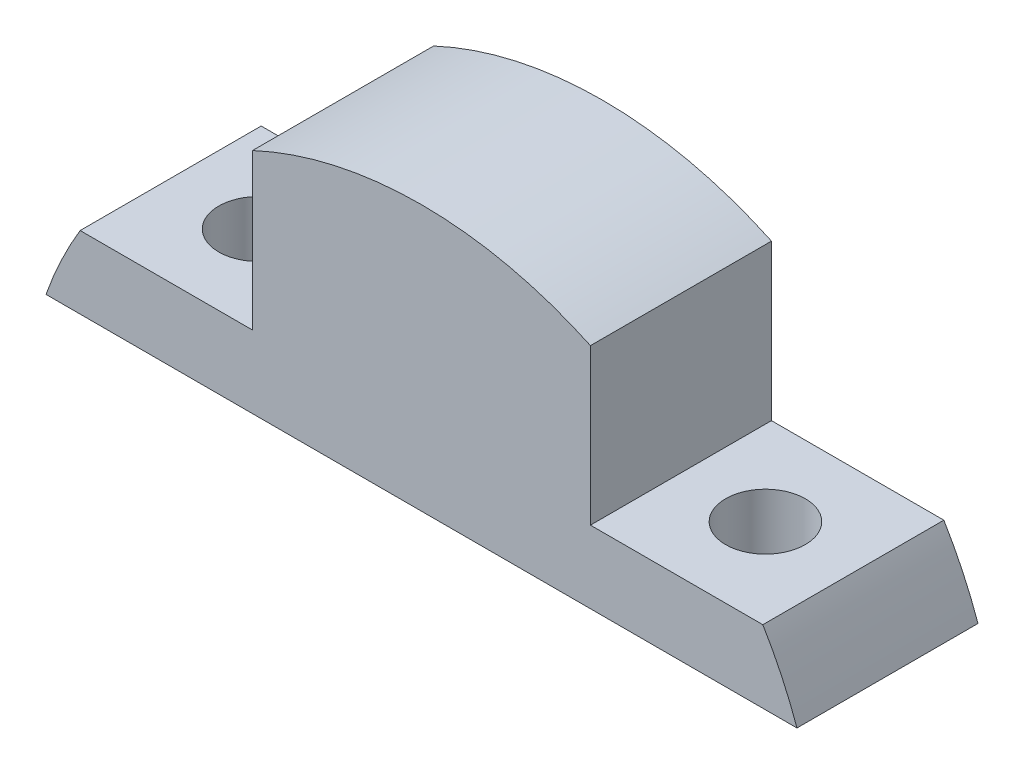
ISO-10303-21;
HEADER;
FILE_DESCRIPTION(('STEP AP214'),'2;1');
FILE_NAME('part.step','',(''),(''),'','','');
FILE_SCHEMA(('AUTOMOTIVE_DESIGN { 1 0 10303 214 1 1 1 1 }'));
ENDSEC;
DATA;
#1=APPLICATION_CONTEXT('core data for automotive mechanical design processes');
#2=APPLICATION_PROTOCOL_DEFINITION('international standard','automotive_design',2000,#1);
#3=PRODUCT_CONTEXT('',#1,'mechanical');
#4=PRODUCT('Part','Part','',(#3));
#5=PRODUCT_RELATED_PRODUCT_CATEGORY('part','',(#4));
#6=PRODUCT_DEFINITION_FORMATION('','',#4);
#7=PRODUCT_DEFINITION_CONTEXT('part definition',#1,'design');
#8=PRODUCT_DEFINITION('design','',#6,#7);
#9=PRODUCT_DEFINITION_SHAPE('','',#8);
#10=(LENGTH_UNIT() NAMED_UNIT(*) SI_UNIT(.MILLI.,.METRE.));
#11=(NAMED_UNIT(*) PLANE_ANGLE_UNIT() SI_UNIT($,.RADIAN.));
#12=(NAMED_UNIT(*) SI_UNIT($,.STERADIAN.) SOLID_ANGLE_UNIT());
#13=UNCERTAINTY_MEASURE_WITH_UNIT(LENGTH_MEASURE(1.E-05),#10,'distance_accuracy_value','');
#14=(GEOMETRIC_REPRESENTATION_CONTEXT(3) GLOBAL_UNCERTAINTY_ASSIGNED_CONTEXT((#13)) GLOBAL_UNIT_ASSIGNED_CONTEXT((#10,
#11,#12)) REPRESENTATION_CONTEXT('',''));
#15=CARTESIAN_POINT('',(0.,0.,0.));
#16=DIRECTION('',(0.,0.,1.));
#17=DIRECTION('',(1.,0.,0.));
#18=AXIS2_PLACEMENT_3D('',#15,#16,#17);
#19=CARTESIAN_POINT('',(40.,6.,7.5));
#20=DIRECTION('',(0.,-1.,0.));
#21=DIRECTION('',(1.,0.,0.));
#22=AXIS2_PLACEMENT_3D('',#19,#20,#21);
#23=PLANE('',#22);
#24=CARTESIAN_POINT('',(21.,5.99999999999999,0.));
#25=DIRECTION('',(0.,1.,0.));
#26=DIRECTION('',(0.,0.,1.));
#27=AXIS2_PLACEMENT_3D('',#24,#25,#26);
#28=CIRCLE('',#27,3.3);
#29=CARTESIAN_POINT('',(21.,5.99999999999999,3.3));
#30=VERTEX_POINT('',#29);
#31=EDGE_CURVE('E208',#30,#30,#28,.T.);
#32=ORIENTED_EDGE('',*,*,#31,.F.);
#33=EDGE_LOOP('',(#32));
#34=FACE_BOUND('',#33,.T.);
#35=DIRECTION('',(-1.,0.,0.));
#36=VECTOR('',#35,1.);
#37=CARTESIAN_POINT('',(40.,6.,7.5));
#38=LINE('',#37,#36);
#39=CARTESIAN_POINT('',(28.2842712474619,5.99999999999999,7.5));
#40=VERTEX_POINT('',#39);
#41=CARTESIAN_POINT('',(14.,6.,7.5));
#42=VERTEX_POINT('',#41);
#43=EDGE_CURVE('E156',#40,#42,#38,.T.);
#44=ORIENTED_EDGE('',*,*,#43,.F.);
#45=DIRECTION('',(0.,0.,1.));
#46=VECTOR('',#45,1.);
#47=CARTESIAN_POINT('',(28.2842712474619,5.99999999999999,-7.5));
#48=LINE('',#47,#46);
#49=CARTESIAN_POINT('',(28.2842712474619,5.99999999999999,-7.5));
#50=VERTEX_POINT('',#49);
#51=EDGE_CURVE('E143',#40,#50,#48,.F.);
#52=ORIENTED_EDGE('',*,*,#51,.T.);
#53=DIRECTION('',(-1.,0.,0.));
#54=VECTOR('',#53,1.);
#55=CARTESIAN_POINT('',(40.,6.,-7.5));
#56=LINE('',#55,#54);
#57=CARTESIAN_POINT('',(14.,6.,-7.5));
#58=VERTEX_POINT('',#57);
#59=EDGE_CURVE('E139',#50,#58,#56,.T.);
#60=ORIENTED_EDGE('',*,*,#59,.T.);
#61=DIRECTION('',(0.,0.,-1.));
#62=VECTOR('',#61,1.);
#63=CARTESIAN_POINT('',(14.,6.,7.5));
#64=LINE('',#63,#62);
#65=EDGE_CURVE('E133',#42,#58,#64,.T.);
#66=ORIENTED_EDGE('',*,*,#65,.F.);
#67=EDGE_LOOP('',(#44,#52,#60,#66));
#68=FACE_BOUND('',#67,.T.);
#69=ADVANCED_FACE('F39',(#34,#68),#23,.F.);
#70=CARTESIAN_POINT('',(14.,22.,7.5));
#71=DIRECTION('',(-1.,0.,0.));
#72=DIRECTION('',(0.,-1.,0.));
#73=AXIS2_PLACEMENT_3D('',#70,#71,#72);
#74=PLANE('',#73);
#75=DIRECTION('',(0.,1.,0.));
#76=VECTOR('',#75,1.);
#77=CARTESIAN_POINT('',(14.,22.,-7.5));
#78=LINE('',#77,#76);
#79=CARTESIAN_POINT('',(14.,18.8831055949679,-7.5));
#80=VERTEX_POINT('',#79);
#81=EDGE_CURVE('E142',#58,#80,#78,.T.);
#82=ORIENTED_EDGE('',*,*,#81,.T.);
#83=DIRECTION('',(0.,0.,1.));
#84=VECTOR('',#83,1.);
#85=CARTESIAN_POINT('',(14.,18.8831055949679,-7.5));
#86=LINE('',#85,#84);
#87=CARTESIAN_POINT('',(14.,18.8831055949679,7.5));
#88=VERTEX_POINT('',#87);
#89=EDGE_CURVE('E54',#80,#88,#86,.T.);
#90=ORIENTED_EDGE('',*,*,#89,.T.);
#91=DIRECTION('',(0.,1.,0.));
#92=VECTOR('',#91,1.);
#93=CARTESIAN_POINT('',(14.,22.,7.5));
#94=LINE('',#93,#92);
#95=EDGE_CURVE('E182',#42,#88,#94,.T.);
#96=ORIENTED_EDGE('',*,*,#95,.F.);
#97=ORIENTED_EDGE('',*,*,#65,.T.);
#98=EDGE_LOOP('',(#82,#90,#96,#97));
#99=FACE_BOUND('',#98,.T.);
#100=ADVANCED_FACE('F231',(#99),#74,.F.);
#101=CARTESIAN_POINT('',(-14.,22.,7.5));
#102=DIRECTION('',(1.,0.,0.));
#103=DIRECTION('',(0.,1.,0.));
#104=AXIS2_PLACEMENT_3D('',#101,#102,#103);
#105=PLANE('',#104);
#106=DIRECTION('',(0.,-1.,0.));
#107=VECTOR('',#106,1.);
#108=CARTESIAN_POINT('',(-14.,22.,7.5));
#109=LINE('',#108,#107);
#110=CARTESIAN_POINT('',(-14.,18.8831055949679,7.5));
#111=VERTEX_POINT('',#110);
#112=CARTESIAN_POINT('',(-14.,6.,7.5));
#113=VERTEX_POINT('',#112);
#114=EDGE_CURVE('E135',#111,#113,#109,.T.);
#115=ORIENTED_EDGE('',*,*,#114,.F.);
#116=DIRECTION('',(0.,0.,1.));
#117=VECTOR('',#116,1.);
#118=CARTESIAN_POINT('',(-14.,18.8831055949679,-7.5));
#119=LINE('',#118,#117);
#120=CARTESIAN_POINT('',(-14.,18.8831055949679,-7.5));
#121=VERTEX_POINT('',#120);
#122=EDGE_CURVE('E176',#111,#121,#119,.F.);
#123=ORIENTED_EDGE('',*,*,#122,.T.);
#124=DIRECTION('',(0.,-1.,0.));
#125=VECTOR('',#124,1.);
#126=CARTESIAN_POINT('',(-14.,22.,-7.5));
#127=LINE('',#126,#125);
#128=CARTESIAN_POINT('',(-14.,6.,-7.5));
#129=VERTEX_POINT('',#128);
#130=EDGE_CURVE('E147',#121,#129,#127,.T.);
#131=ORIENTED_EDGE('',*,*,#130,.T.);
#132=DIRECTION('',(0.,0.,-1.));
#133=VECTOR('',#132,1.);
#134=CARTESIAN_POINT('',(-14.,6.,7.5));
#135=LINE('',#134,#133);
#136=EDGE_CURVE('E128',#113,#129,#135,.T.);
#137=ORIENTED_EDGE('',*,*,#136,.F.);
#138=EDGE_LOOP('',(#115,#123,#131,#137));
#139=FACE_BOUND('',#138,.T.);
#140=ADVANCED_FACE('F191',(#139),#105,.F.);
#141=CARTESIAN_POINT('',(-40.,6.,7.5));
#142=DIRECTION('',(0.,-1.,0.));
#143=DIRECTION('',(1.,0.,0.));
#144=AXIS2_PLACEMENT_3D('',#141,#142,#143);
#145=PLANE('',#144);
#146=CARTESIAN_POINT('',(-21.,6.,0.));
#147=DIRECTION('',(0.,1.,0.));
#148=DIRECTION('',(0.,0.,1.));
#149=AXIS2_PLACEMENT_3D('',#146,#147,#148);
#150=CIRCLE('',#149,3.3);
#151=CARTESIAN_POINT('',(-21.,6.,3.3));
#152=VERTEX_POINT('',#151);
#153=EDGE_CURVE('E216',#152,#152,#150,.T.);
#154=ORIENTED_EDGE('',*,*,#153,.F.);
#155=EDGE_LOOP('',(#154));
#156=FACE_BOUND('',#155,.T.);
#157=DIRECTION('',(-1.,0.,0.));
#158=VECTOR('',#157,1.);
#159=CARTESIAN_POINT('',(-40.,6.,-7.5));
#160=LINE('',#159,#158);
#161=CARTESIAN_POINT('',(-28.2842712474619,5.99999999999999,-7.5));
#162=VERTEX_POINT('',#161);
#163=EDGE_CURVE('E150',#129,#162,#160,.T.);
#164=ORIENTED_EDGE('',*,*,#163,.T.);
#165=DIRECTION('',(0.,0.,1.));
#166=VECTOR('',#165,1.);
#167=CARTESIAN_POINT('',(-28.2842712474619,5.99999999999999,-7.5));
#168=LINE('',#167,#166);
#169=CARTESIAN_POINT('',(-28.2842712474619,5.99999999999999,7.5));
#170=VERTEX_POINT('',#169);
#171=EDGE_CURVE('E61',#162,#170,#168,.T.);
#172=ORIENTED_EDGE('',*,*,#171,.T.);
#173=DIRECTION('',(-1.,0.,0.));
#174=VECTOR('',#173,1.);
#175=CARTESIAN_POINT('',(-40.,6.,7.5));
#176=LINE('',#175,#174);
#177=EDGE_CURVE('E120',#113,#170,#176,.T.);
#178=ORIENTED_EDGE('',*,*,#177,.F.);
#179=ORIENTED_EDGE('',*,*,#136,.T.);
#180=EDGE_LOOP('',(#164,#172,#178,#179));
#181=FACE_BOUND('',#180,.T.);
#182=ADVANCED_FACE('F195',(#156,#181),#145,.F.);
#183=CARTESIAN_POINT('',(-40.,0.,7.5));
#184=DIRECTION('',(0.,1.,0.));
#185=DIRECTION('',(0.,0.,1.));
#186=AXIS2_PLACEMENT_3D('',#183,#184,#185);
#187=PLANE('',#186);
#188=CARTESIAN_POINT('',(-21.,0.,0.));
#189=DIRECTION('',(0.,1.,0.));
#190=DIRECTION('',(0.,0.,1.));
#191=AXIS2_PLACEMENT_3D('',#188,#189,#190);
#192=CIRCLE('',#191,3.3);
#193=CARTESIAN_POINT('',(-21.,0.,3.3));
#194=VERTEX_POINT('',#193);
#195=EDGE_CURVE('E212',#194,#194,#192,.T.);
#196=ORIENTED_EDGE('',*,*,#195,.T.);
#197=EDGE_LOOP('',(#196));
#198=FACE_BOUND('',#197,.T.);
#199=CARTESIAN_POINT('',(21.,0.,0.));
#200=DIRECTION('',(0.,1.,0.));
#201=DIRECTION('',(0.,0.,1.));
#202=AXIS2_PLACEMENT_3D('',#199,#200,#201);
#203=CIRCLE('',#202,3.3);
#204=CARTESIAN_POINT('',(21.,0.,3.3));
#205=VERTEX_POINT('',#204);
#206=EDGE_CURVE('E204',#205,#205,#203,.T.);
#207=ORIENTED_EDGE('',*,*,#206,.T.);
#208=EDGE_LOOP('',(#207));
#209=FACE_BOUND('',#208,.T.);
#210=DIRECTION('',(1.,0.,0.));
#211=VECTOR('',#210,1.);
#212=CARTESIAN_POINT('',(-40.,0.,7.5));
#213=LINE('',#212,#211);
#214=CARTESIAN_POINT('',(-31.1126983722081,0.,7.5));
#215=VERTEX_POINT('',#214);
#216=CARTESIAN_POINT('',(31.1126983722081,0.,7.5));
#217=VERTEX_POINT('',#216);
#218=EDGE_CURVE('E118',#215,#217,#213,.T.);
#219=ORIENTED_EDGE('',*,*,#218,.F.);
#220=DIRECTION('',(0.,0.,1.));
#221=VECTOR('',#220,1.);
#222=CARTESIAN_POINT('',(-31.1126983722081,0.,-7.5));
#223=LINE('',#222,#221);
#224=CARTESIAN_POINT('',(-31.1126983722081,0.,-7.5));
#225=VERTEX_POINT('',#224);
#226=EDGE_CURVE('E101',#225,#215,#223,.T.);
#227=ORIENTED_EDGE('',*,*,#226,.F.);
#228=DIRECTION('',(1.,0.,0.));
#229=VECTOR('',#228,1.);
#230=CARTESIAN_POINT('',(-40.,0.,-7.5));
#231=LINE('',#230,#229);
#232=CARTESIAN_POINT('',(31.1126983722081,0.,-7.5));
#233=VERTEX_POINT('',#232);
#234=EDGE_CURVE('E154',#225,#233,#231,.T.);
#235=ORIENTED_EDGE('',*,*,#234,.T.);
#236=DIRECTION('',(0.,0.,1.));
#237=VECTOR('',#236,1.);
#238=CARTESIAN_POINT('',(31.1126983722081,0.,-7.5));
#239=LINE('',#238,#237);
#240=EDGE_CURVE('E111',#233,#217,#239,.T.);
#241=ORIENTED_EDGE('',*,*,#240,.T.);
#242=EDGE_LOOP('',(#219,#227,#235,#241));
#243=FACE_BOUND('',#242,.T.);
#244=ADVANCED_FACE('F126',(#198,#209,#243),#187,.F.);
#245=CARTESIAN_POINT('',(0.,0.,7.5));
#246=DIRECTION('',(0.,0.,1.));
#247=DIRECTION('',(1.,0.,0.));
#248=AXIS2_PLACEMENT_3D('',#245,#246,#247);
#249=PLANE('',#248);
#250=CARTESIAN_POINT('',(0.,-11.,7.5));
#251=DIRECTION('',(0.,0.,-1.));
#252=DIRECTION('',(1.,0.,0.));
#253=AXIS2_PLACEMENT_3D('',#250,#251,#252);
#254=CIRCLE('',#253,33.);
#255=EDGE_CURVE('E104',#215,#170,#254,.T.);
#256=ORIENTED_EDGE('',*,*,#255,.F.);
#257=ORIENTED_EDGE('',*,*,#218,.T.);
#258=EDGE_CURVE('E124',#40,#217,#254,.T.);
#259=ORIENTED_EDGE('',*,*,#258,.F.);
#260=ORIENTED_EDGE('',*,*,#43,.T.);
#261=ORIENTED_EDGE('',*,*,#95,.T.);
#262=EDGE_CURVE('E122',#111,#88,#254,.T.);
#263=ORIENTED_EDGE('',*,*,#262,.F.);
#264=ORIENTED_EDGE('',*,*,#114,.T.);
#265=ORIENTED_EDGE('',*,*,#177,.T.);
#266=EDGE_LOOP('',(#256,#257,#259,#260,#261,#263,#264,#265));
#267=FACE_BOUND('',#266,.T.);
#268=ADVANCED_FACE('F116',(#267),#249,.T.);
#269=CARTESIAN_POINT('',(0.,0.,-7.5));
#270=DIRECTION('',(0.,0.,1.));
#271=DIRECTION('',(1.,0.,0.));
#272=AXIS2_PLACEMENT_3D('',#269,#270,#271);
#273=PLANE('',#272);
#274=ORIENTED_EDGE('',*,*,#234,.F.);
#275=CARTESIAN_POINT('',(0.,-11.,-7.5));
#276=DIRECTION('',(0.,0.,-1.));
#277=DIRECTION('',(1.,0.,0.));
#278=AXIS2_PLACEMENT_3D('',#275,#276,#277);
#279=CIRCLE('',#278,33.);
#280=EDGE_CURVE('E105',#225,#162,#279,.T.);
#281=ORIENTED_EDGE('',*,*,#280,.T.);
#282=ORIENTED_EDGE('',*,*,#163,.F.);
#283=ORIENTED_EDGE('',*,*,#130,.F.);
#284=CARTESIAN_POINT('',(0.,-11.,-7.5));
#285=DIRECTION('',(0.,0.,1.));
#286=DIRECTION('',(1.,0.,0.));
#287=AXIS2_PLACEMENT_3D('',#284,#285,#286);
#288=CIRCLE('',#287,33.);
#289=EDGE_CURVE('E11',#121,#80,#288,.F.);
#290=ORIENTED_EDGE('',*,*,#289,.T.);
#291=ORIENTED_EDGE('',*,*,#81,.F.);
#292=ORIENTED_EDGE('',*,*,#59,.F.);
#293=EDGE_CURVE('E42',#50,#233,#288,.F.);
#294=ORIENTED_EDGE('',*,*,#293,.T.);
#295=EDGE_LOOP('',(#274,#281,#282,#283,#290,#291,#292,#294));
#296=FACE_BOUND('',#295,.T.);
#297=ADVANCED_FACE('F167',(#296),#273,.F.);
#298=CARTESIAN_POINT('',(0.,-11.,-7.5));
#299=DIRECTION('',(0.,0.,1.));
#300=DIRECTION('',(1.,0.,0.));
#301=AXIS2_PLACEMENT_3D('',#298,#299,#300);
#302=CYLINDRICAL_SURFACE('',#301,33.);
#303=ORIENTED_EDGE('',*,*,#258,.T.);
#304=ORIENTED_EDGE('',*,*,#240,.F.);
#305=ORIENTED_EDGE('',*,*,#293,.F.);
#306=ORIENTED_EDGE('',*,*,#51,.F.);
#307=EDGE_LOOP('',(#303,#304,#305,#306));
#308=FACE_BOUND('',#307,.T.);
#309=ADVANCED_FACE('F170',(#308),#302,.T.);
#310=ORIENTED_EDGE('',*,*,#289,.F.);
#311=ORIENTED_EDGE('',*,*,#122,.F.);
#312=ORIENTED_EDGE('',*,*,#262,.T.);
#313=ORIENTED_EDGE('',*,*,#89,.F.);
#314=EDGE_LOOP('',(#310,#311,#312,#313));
#315=FACE_BOUND('',#314,.T.);
#316=ADVANCED_FACE('F250',(#315),#302,.T.);
#317=ORIENTED_EDGE('',*,*,#280,.F.);
#318=ORIENTED_EDGE('',*,*,#226,.T.);
#319=ORIENTED_EDGE('',*,*,#255,.T.);
#320=ORIENTED_EDGE('',*,*,#171,.F.);
#321=EDGE_LOOP('',(#317,#318,#319,#320));
#322=FACE_BOUND('',#321,.T.);
#323=ADVANCED_FACE('F103',(#322),#302,.T.);
#324=CARTESIAN_POINT('',(21.,5.99999999999999,0.));
#325=DIRECTION('',(0.,1.,0.));
#326=DIRECTION('',(0.,0.,1.));
#327=AXIS2_PLACEMENT_3D('',#324,#325,#326);
#328=CYLINDRICAL_SURFACE('',#327,3.3);
#329=ORIENTED_EDGE('',*,*,#206,.F.);
#330=EDGE_LOOP('',(#329));
#331=FACE_BOUND('',#330,.T.);
#332=ORIENTED_EDGE('',*,*,#31,.T.);
#333=EDGE_LOOP('',(#332));
#334=FACE_BOUND('',#333,.T.);
#335=ADVANCED_FACE('F240',(#331,#334),#328,.F.);
#336=CARTESIAN_POINT('',(-21.,6.,0.));
#337=DIRECTION('',(0.,1.,0.));
#338=DIRECTION('',(0.,0.,1.));
#339=AXIS2_PLACEMENT_3D('',#336,#337,#338);
#340=CYLINDRICAL_SURFACE('',#339,3.3);
#341=ORIENTED_EDGE('',*,*,#195,.F.);
#342=EDGE_LOOP('',(#341));
#343=FACE_BOUND('',#342,.T.);
#344=ORIENTED_EDGE('',*,*,#153,.T.);
#345=EDGE_LOOP('',(#344));
#346=FACE_BOUND('',#345,.T.);
#347=ADVANCED_FACE('F221',(#343,#346),#340,.F.);
#348=CLOSED_SHELL('',(#69,#100,#140,#182,#244,#268,#297,#309,#316,#323,#335,#347));
#349=MANIFOLD_SOLID_BREP('B2',#348);
#350=ADVANCED_BREP_SHAPE_REPRESENTATION('',(#18,#349),#14);
#351=SHAPE_DEFINITION_REPRESENTATION(#9,#350);
ENDSEC;
END-ISO-10303-21;
